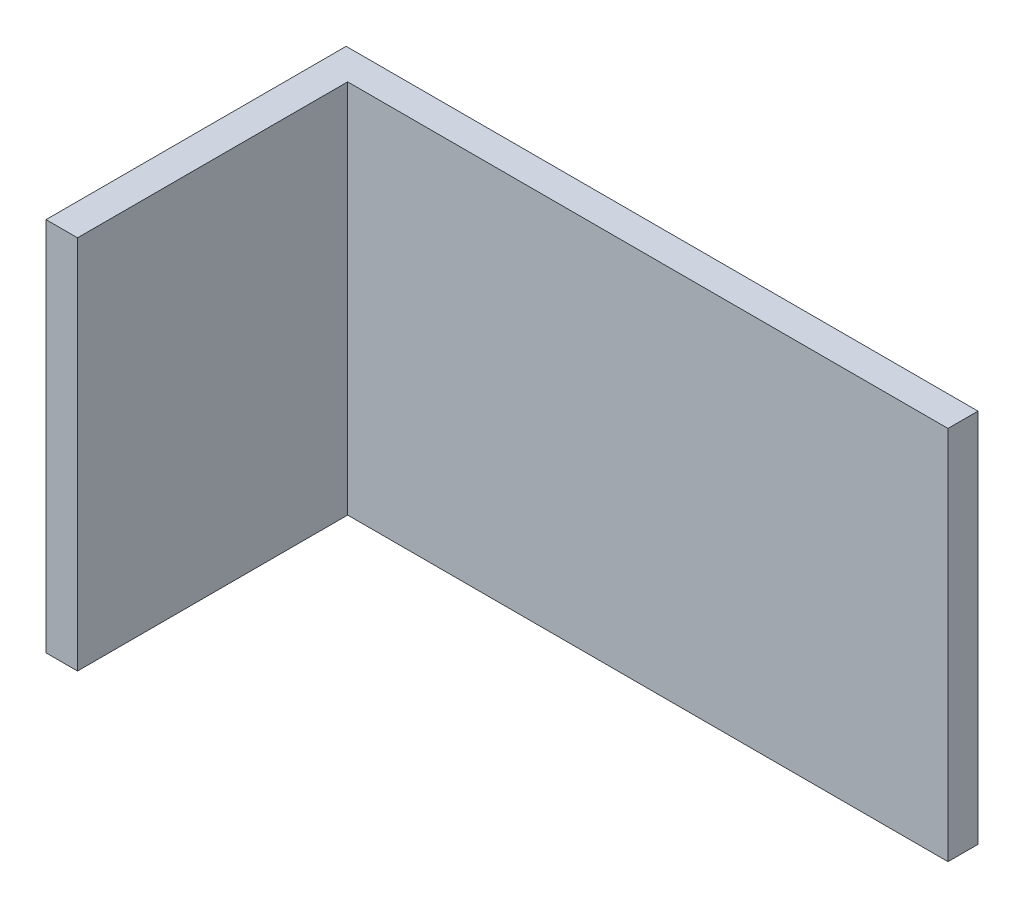
ISO-10303-21;
HEADER;
FILE_DESCRIPTION(('STEP AP214'),'2;1');
FILE_NAME('part.step','',(''),(''),'','','');
FILE_SCHEMA(('AUTOMOTIVE_DESIGN { 1 0 10303 214 1 1 1 1 }'));
ENDSEC;
DATA;
#1=APPLICATION_CONTEXT('core data for automotive mechanical design processes');
#2=APPLICATION_PROTOCOL_DEFINITION('international standard','automotive_design',2000,#1);
#3=PRODUCT_CONTEXT('',#1,'mechanical');
#4=PRODUCT('Part','Part','',(#3));
#5=PRODUCT_RELATED_PRODUCT_CATEGORY('part','',(#4));
#6=PRODUCT_DEFINITION_FORMATION('','',#4);
#7=PRODUCT_DEFINITION_CONTEXT('part definition',#1,'design');
#8=PRODUCT_DEFINITION('design','',#6,#7);
#9=PRODUCT_DEFINITION_SHAPE('','',#8);
#10=(LENGTH_UNIT() NAMED_UNIT(*) SI_UNIT(.MILLI.,.METRE.));
#11=(NAMED_UNIT(*) PLANE_ANGLE_UNIT() SI_UNIT($,.RADIAN.));
#12=(NAMED_UNIT(*) SI_UNIT($,.STERADIAN.) SOLID_ANGLE_UNIT());
#13=UNCERTAINTY_MEASURE_WITH_UNIT(LENGTH_MEASURE(1.E-05),#10,'distance_accuracy_value','');
#14=(GEOMETRIC_REPRESENTATION_CONTEXT(3) GLOBAL_UNCERTAINTY_ASSIGNED_CONTEXT((#13)) GLOBAL_UNIT_ASSIGNED_CONTEXT((#10,
#11,#12)) REPRESENTATION_CONTEXT('',''));
#15=CARTESIAN_POINT('',(0.,0.,0.));
#16=DIRECTION('',(0.,0.,1.));
#17=DIRECTION('',(1.,0.,0.));
#18=AXIS2_PLACEMENT_3D('',#15,#16,#17);
#19=CARTESIAN_POINT('',(-1.53882069959544,-0.25,0.2));
#20=DIRECTION('',(0.,0.,1.));
#21=DIRECTION('',(1.,0.,0.));
#22=AXIS2_PLACEMENT_3D('',#19,#20,#21);
#23=PLANE('',#22);
#24=DIRECTION('',(0.,-1.,0.));
#25=VECTOR('',#24,1.);
#26=CARTESIAN_POINT('',(-1.54932069959544,-0.25,0.2));
#27=LINE('',#26,#25);
#28=CARTESIAN_POINT('',(-1.54932069959544,-0.125,0.2));
#29=VERTEX_POINT('',#28);
#30=CARTESIAN_POINT('',(-1.54932069959544,-0.375,0.2));
#31=VERTEX_POINT('',#30);
#32=EDGE_CURVE('E137',#29,#31,#27,.T.);
#33=ORIENTED_EDGE('',*,*,#32,.T.);
#34=DIRECTION('',(1.,0.,0.));
#35=VECTOR('',#34,1.);
#36=CARTESIAN_POINT('',(-1.39679171408819,-0.375,0.2));
#37=LINE('',#36,#35);
#38=CARTESIAN_POINT('',(-1.52832069959544,-0.375,0.2));
#39=VERTEX_POINT('',#38);
#40=EDGE_CURVE('E20',#31,#39,#37,.T.);
#41=ORIENTED_EDGE('',*,*,#40,.T.);
#42=DIRECTION('',(0.,-1.,0.));
#43=VECTOR('',#42,1.);
#44=CARTESIAN_POINT('',(-1.52832069959544,-0.25,0.2));
#45=LINE('',#44,#43);
#46=CARTESIAN_POINT('',(-1.52832069959544,-0.125,0.2));
#47=VERTEX_POINT('',#46);
#48=EDGE_CURVE('E11',#47,#39,#45,.T.);
#49=ORIENTED_EDGE('',*,*,#48,.F.);
#50=DIRECTION('',(1.,0.,0.));
#51=VECTOR('',#50,1.);
#52=CARTESIAN_POINT('',(-1.39679171408819,-0.125,0.2));
#53=LINE('',#52,#51);
#54=EDGE_CURVE('E124',#29,#47,#53,.T.);
#55=ORIENTED_EDGE('',*,*,#54,.F.);
#56=EDGE_LOOP('',(#33,#41,#49,#55));
#57=FACE_BOUND('',#56,.T.);
#58=ADVANCED_FACE('F16',(#57),#23,.T.);
#59=CARTESIAN_POINT('',(-1.52832069959544,-0.25,0.11));
#60=DIRECTION('',(1.,0.,0.));
#61=DIRECTION('',(0.,0.,1.));
#62=AXIS2_PLACEMENT_3D('',#59,#60,#61);
#63=PLANE('',#62);
#64=DIRECTION('',(0.,0.,-1.));
#65=VECTOR('',#64,1.);
#66=CARTESIAN_POINT('',(-1.52832069959544,-0.125,0.0420289855072459));
#67=LINE('',#66,#65);
#68=CARTESIAN_POINT('',(-1.52832069959544,-0.125,0.02));
#69=VERTEX_POINT('',#68);
#70=EDGE_CURVE('E128',#47,#69,#67,.T.);
#71=ORIENTED_EDGE('',*,*,#70,.F.);
#72=ORIENTED_EDGE('',*,*,#48,.T.);
#73=DIRECTION('',(0.,0.,-1.));
#74=VECTOR('',#73,1.);
#75=CARTESIAN_POINT('',(-1.52832069959544,-0.375,0.0420289855072459));
#76=LINE('',#75,#74);
#77=CARTESIAN_POINT('',(-1.52832069959544,-0.375,0.02));
#78=VERTEX_POINT('',#77);
#79=EDGE_CURVE('E106',#39,#78,#76,.T.);
#80=ORIENTED_EDGE('',*,*,#79,.T.);
#81=DIRECTION('',(0.,-1.,0.));
#82=VECTOR('',#81,1.);
#83=CARTESIAN_POINT('',(-1.52832069959544,-0.25,0.02));
#84=LINE('',#83,#82);
#85=EDGE_CURVE('E27',#69,#78,#84,.T.);
#86=ORIENTED_EDGE('',*,*,#85,.F.);
#87=EDGE_LOOP('',(#71,#72,#80,#86));
#88=FACE_BOUND('',#87,.T.);
#89=ADVANCED_FACE('F107',(#88),#63,.T.);
#90=CARTESIAN_POINT('',(-1.32832069959544,-0.25,0.02));
#91=DIRECTION('',(0.,0.,1.));
#92=DIRECTION('',(1.,0.,0.));
#93=AXIS2_PLACEMENT_3D('',#90,#91,#92);
#94=PLANE('',#93);
#95=DIRECTION('',(1.,0.,0.));
#96=VECTOR('',#95,1.);
#97=CARTESIAN_POINT('',(-1.39679171408819,-0.375,0.02));
#98=LINE('',#97,#96);
#99=CARTESIAN_POINT('',(-1.12832069959544,-0.375,0.02));
#100=VERTEX_POINT('',#99);
#101=EDGE_CURVE('E100',#78,#100,#98,.T.);
#102=ORIENTED_EDGE('',*,*,#101,.T.);
#103=DIRECTION('',(0.,-1.,0.));
#104=VECTOR('',#103,1.);
#105=CARTESIAN_POINT('',(-1.12832069959544,-0.25,0.02));
#106=LINE('',#105,#104);
#107=CARTESIAN_POINT('',(-1.12832069959544,-0.125,0.02));
#108=VERTEX_POINT('',#107);
#109=EDGE_CURVE('E113',#108,#100,#106,.T.);
#110=ORIENTED_EDGE('',*,*,#109,.F.);
#111=DIRECTION('',(1.,0.,0.));
#112=VECTOR('',#111,1.);
#113=CARTESIAN_POINT('',(-1.39679171408819,-0.125,0.02));
#114=LINE('',#113,#112);
#115=EDGE_CURVE('E101',#69,#108,#114,.T.);
#116=ORIENTED_EDGE('',*,*,#115,.F.);
#117=ORIENTED_EDGE('',*,*,#85,.T.);
#118=EDGE_LOOP('',(#102,#110,#116,#117));
#119=FACE_BOUND('',#118,.T.);
#120=ADVANCED_FACE('F97',(#119),#94,.T.);
#121=CARTESIAN_POINT('',(-1.39679171408819,-0.125,0.0420289855072459));
#122=DIRECTION('',(0.,1.,0.));
#123=DIRECTION('',(1.,0.,0.));
#124=AXIS2_PLACEMENT_3D('',#121,#122,#123);
#125=PLANE('',#124);
#126=DIRECTION('',(0.,0.,1.));
#127=VECTOR('',#126,1.);
#128=CARTESIAN_POINT('',(-1.54932069959544,-0.125,0.0999999999999988));
#129=LINE('',#128,#127);
#130=CARTESIAN_POINT('',(-1.54932069959544,-0.125,0.));
#131=VERTEX_POINT('',#130);
#132=EDGE_CURVE('E129',#131,#29,#129,.T.);
#133=ORIENTED_EDGE('',*,*,#132,.T.);
#134=ORIENTED_EDGE('',*,*,#54,.T.);
#135=ORIENTED_EDGE('',*,*,#70,.T.);
#136=ORIENTED_EDGE('',*,*,#115,.T.);
#137=DIRECTION('',(0.,0.,1.));
#138=VECTOR('',#137,1.);
#139=CARTESIAN_POINT('',(-1.12832069959544,-0.125,0.01));
#140=LINE('',#139,#138);
#141=CARTESIAN_POINT('',(-1.12832069959544,-0.125,0.));
#142=VERTEX_POINT('',#141);
#143=EDGE_CURVE('E119',#142,#108,#140,.T.);
#144=ORIENTED_EDGE('',*,*,#143,.F.);
#145=DIRECTION('',(-1.,0.,0.));
#146=VECTOR('',#145,1.);
#147=CARTESIAN_POINT('',(-1.33882069959543,-0.125,0.));
#148=LINE('',#147,#146);
#149=EDGE_CURVE('E133',#142,#131,#148,.T.);
#150=ORIENTED_EDGE('',*,*,#149,.T.);
#151=EDGE_LOOP('',(#133,#134,#135,#136,#144,#150));
#152=FACE_BOUND('',#151,.T.);
#153=ADVANCED_FACE('F18',(#152),#125,.T.);
#154=CARTESIAN_POINT('',(-1.54932069959544,-0.25,0.0999999999999988));
#155=DIRECTION('',(1.,0.,0.));
#156=DIRECTION('',(0.,0.,1.));
#157=AXIS2_PLACEMENT_3D('',#154,#155,#156);
#158=PLANE('',#157);
#159=DIRECTION('',(0.,-1.,0.));
#160=VECTOR('',#159,1.);
#161=CARTESIAN_POINT('',(-1.54932069959544,-0.25,0.));
#162=LINE('',#161,#160);
#163=CARTESIAN_POINT('',(-1.54932069959544,-0.375,0.));
#164=VERTEX_POINT('',#163);
#165=EDGE_CURVE('E138',#131,#164,#162,.T.);
#166=ORIENTED_EDGE('',*,*,#165,.T.);
#167=DIRECTION('',(0.,0.,1.));
#168=VECTOR('',#167,1.);
#169=CARTESIAN_POINT('',(-1.54932069959544,-0.375,0.0420289855072459));
#170=LINE('',#169,#168);
#171=EDGE_CURVE('E65',#164,#31,#170,.T.);
#172=ORIENTED_EDGE('',*,*,#171,.T.);
#173=ORIENTED_EDGE('',*,*,#32,.F.);
#174=ORIENTED_EDGE('',*,*,#132,.F.);
#175=EDGE_LOOP('',(#166,#172,#173,#174));
#176=FACE_BOUND('',#175,.T.);
#177=ADVANCED_FACE('F164',(#176),#158,.F.);
#178=CARTESIAN_POINT('',(-1.39679171408819,-0.375,0.0420289855072459));
#179=DIRECTION('',(0.,1.,0.));
#180=DIRECTION('',(0.,0.,-1.));
#181=AXIS2_PLACEMENT_3D('',#178,#179,#180);
#182=PLANE('',#181);
#183=ORIENTED_EDGE('',*,*,#101,.F.);
#184=ORIENTED_EDGE('',*,*,#79,.F.);
#185=ORIENTED_EDGE('',*,*,#40,.F.);
#186=ORIENTED_EDGE('',*,*,#171,.F.);
#187=DIRECTION('',(1.,0.,0.));
#188=VECTOR('',#187,1.);
#189=CARTESIAN_POINT('',(-1.33882069959543,-0.375,0.));
#190=LINE('',#189,#188);
#191=CARTESIAN_POINT('',(-1.12832069959544,-0.375,0.));
#192=VERTEX_POINT('',#191);
#193=EDGE_CURVE('E140',#164,#192,#190,.T.);
#194=ORIENTED_EDGE('',*,*,#193,.T.);
#195=DIRECTION('',(0.,0.,-1.));
#196=VECTOR('',#195,1.);
#197=CARTESIAN_POINT('',(-1.12832069959544,-0.375,0.01));
#198=LINE('',#197,#196);
#199=EDGE_CURVE('E77',#100,#192,#198,.T.);
#200=ORIENTED_EDGE('',*,*,#199,.F.);
#201=EDGE_LOOP('',(#183,#184,#185,#186,#194,#200));
#202=FACE_BOUND('',#201,.T.);
#203=ADVANCED_FACE('F111',(#202),#182,.F.);
#204=CARTESIAN_POINT('',(-1.12832069959544,-0.25,0.01));
#205=DIRECTION('',(1.,0.,0.));
#206=DIRECTION('',(0.,0.,-1.));
#207=AXIS2_PLACEMENT_3D('',#204,#205,#206);
#208=PLANE('',#207);
#209=ORIENTED_EDGE('',*,*,#199,.T.);
#210=DIRECTION('',(0.,1.,0.));
#211=VECTOR('',#210,1.);
#212=CARTESIAN_POINT('',(-1.12832069959544,-0.25,0.));
#213=LINE('',#212,#211);
#214=EDGE_CURVE('E130',#192,#142,#213,.T.);
#215=ORIENTED_EDGE('',*,*,#214,.T.);
#216=ORIENTED_EDGE('',*,*,#143,.T.);
#217=ORIENTED_EDGE('',*,*,#109,.T.);
#218=EDGE_LOOP('',(#209,#215,#216,#217));
#219=FACE_BOUND('',#218,.T.);
#220=ADVANCED_FACE('F189',(#219),#208,.T.);
#221=CARTESIAN_POINT('',(-1.33882069959543,-0.25,0.));
#222=DIRECTION('',(0.,0.,1.));
#223=DIRECTION('',(1.,0.,0.));
#224=AXIS2_PLACEMENT_3D('',#221,#222,#223);
#225=PLANE('',#224);
#226=ORIENTED_EDGE('',*,*,#193,.F.);
#227=ORIENTED_EDGE('',*,*,#165,.F.);
#228=ORIENTED_EDGE('',*,*,#149,.F.);
#229=ORIENTED_EDGE('',*,*,#214,.F.);
#230=EDGE_LOOP('',(#226,#227,#228,#229));
#231=FACE_BOUND('',#230,.T.);
#232=ADVANCED_FACE('F185',(#231),#225,.F.);
#233=CLOSED_SHELL('',(#58,#89,#120,#153,#177,#203,#220,#232));
#234=MANIFOLD_SOLID_BREP('B1',#233);
#235=ADVANCED_BREP_SHAPE_REPRESENTATION('',(#18,#234),#14);
#236=SHAPE_DEFINITION_REPRESENTATION(#9,#235);
ENDSEC;
END-ISO-10303-21;
